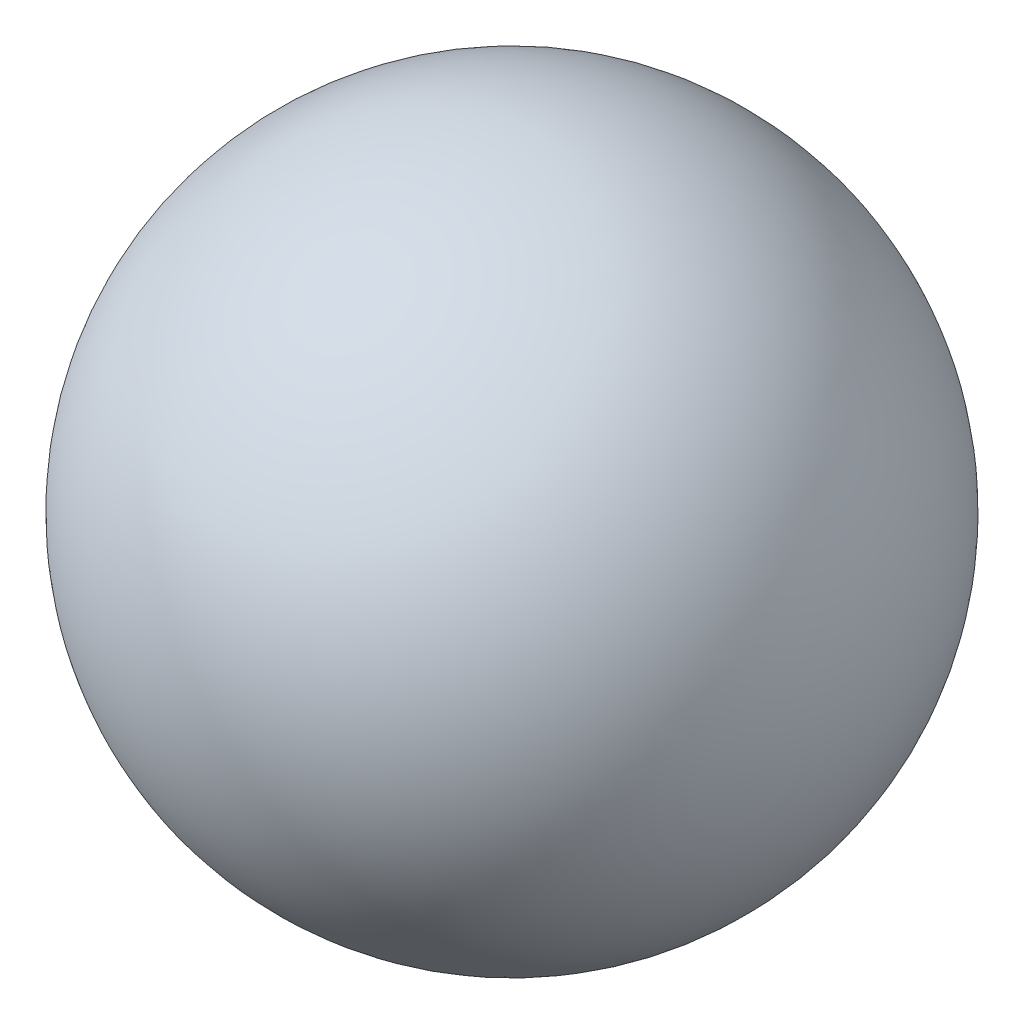
ISO-10303-21;
HEADER;
FILE_DESCRIPTION(('STEP AP214'),'2;1');
FILE_NAME('part.step','',(''),(''),'','','');
FILE_SCHEMA(('AUTOMOTIVE_DESIGN { 1 0 10303 214 1 1 1 1 }'));
ENDSEC;
DATA;
#1=APPLICATION_CONTEXT('core data for automotive mechanical design processes');
#2=APPLICATION_PROTOCOL_DEFINITION('international standard','automotive_design',2000,#1);
#3=PRODUCT_CONTEXT('',#1,'mechanical');
#4=PRODUCT('Part','Part','',(#3));
#5=PRODUCT_RELATED_PRODUCT_CATEGORY('part','',(#4));
#6=PRODUCT_DEFINITION_FORMATION('','',#4);
#7=PRODUCT_DEFINITION_CONTEXT('part definition',#1,'design');
#8=PRODUCT_DEFINITION('design','',#6,#7);
#9=PRODUCT_DEFINITION_SHAPE('','',#8);
#10=(LENGTH_UNIT() NAMED_UNIT(*) SI_UNIT(.MILLI.,.METRE.));
#11=(NAMED_UNIT(*) PLANE_ANGLE_UNIT() SI_UNIT($,.RADIAN.));
#12=(NAMED_UNIT(*) SI_UNIT($,.STERADIAN.) SOLID_ANGLE_UNIT());
#13=UNCERTAINTY_MEASURE_WITH_UNIT(LENGTH_MEASURE(1.E-05),#10,'distance_accuracy_value','');
#14=(GEOMETRIC_REPRESENTATION_CONTEXT(3) GLOBAL_UNCERTAINTY_ASSIGNED_CONTEXT((#13)) GLOBAL_UNIT_ASSIGNED_CONTEXT((#10,
#11,#12)) REPRESENTATION_CONTEXT('',''));
#15=CARTESIAN_POINT('',(0.,0.,0.));
#16=DIRECTION('',(0.,0.,1.));
#17=DIRECTION('',(1.,0.,0.));
#18=AXIS2_PLACEMENT_3D('',#15,#16,#17);
#19=CARTESIAN_POINT('',(0.,0.,0.));
#20=DIRECTION('',(0.,0.,-1.));
#21=DIRECTION('',(1.,0.,0.));
#22=AXIS2_PLACEMENT_3D('',#19,#20,#21);
#23=SPHERICAL_SURFACE('',#22,16.);
#24=CARTESIAN_POINT('',(0.,0.,-16.));
#25=VERTEX_POINT('',#24);
#26=VERTEX_LOOP('',#25);
#27=FACE_BOUND('',#26,.T.);
#28=ADVANCED_FACE('F33',(#27),#23,.T.);
#29=CLOSED_SHELL('',(#28));
#30=MANIFOLD_SOLID_BREP('B2',#29);
#31=ADVANCED_BREP_SHAPE_REPRESENTATION('',(#18,#30),#14);
#32=SHAPE_DEFINITION_REPRESENTATION(#9,#31);
ENDSEC;
END-ISO-10303-21;
